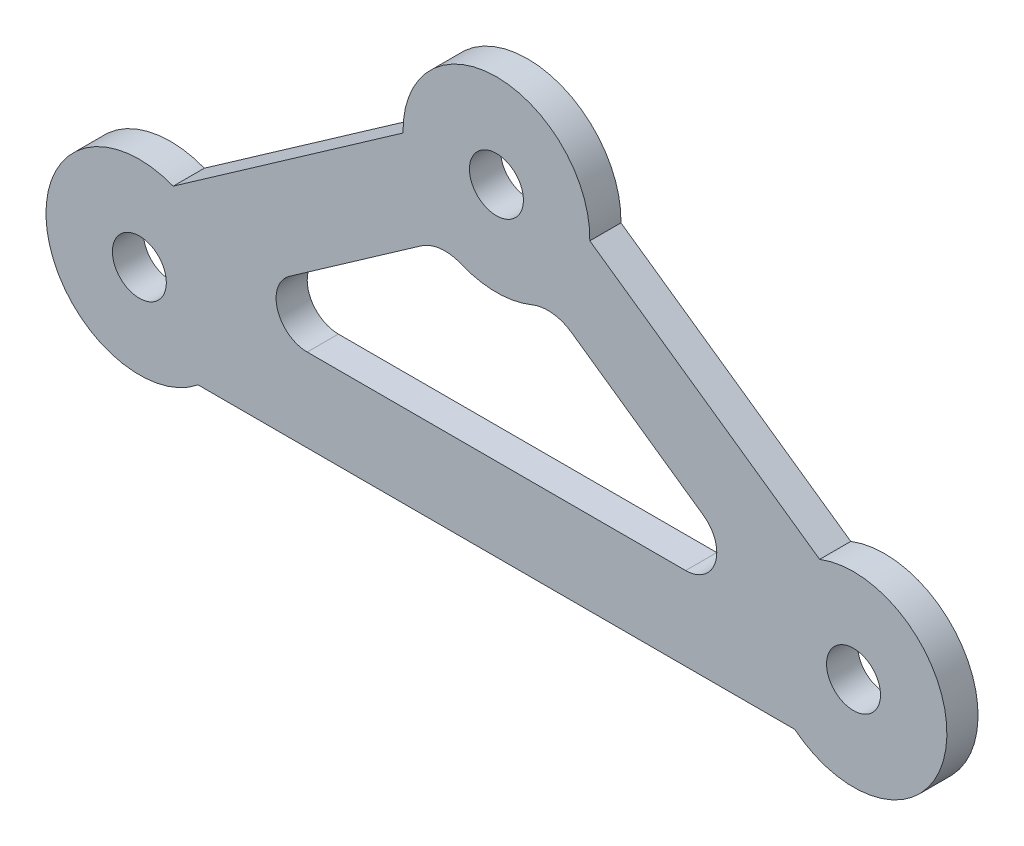
ISO-10303-21;
HEADER;
FILE_DESCRIPTION(('STEP AP214'),'2;1');
FILE_NAME('part.step','',(''),(''),'','','');
FILE_SCHEMA(('AUTOMOTIVE_DESIGN { 1 0 10303 214 1 1 1 1 }'));
ENDSEC;
DATA;
#1=APPLICATION_CONTEXT('core data for automotive mechanical design processes');
#2=APPLICATION_PROTOCOL_DEFINITION('international standard','automotive_design',2000,#1);
#3=PRODUCT_CONTEXT('',#1,'mechanical');
#4=PRODUCT('Part','Part','',(#3));
#5=PRODUCT_RELATED_PRODUCT_CATEGORY('part','',(#4));
#6=PRODUCT_DEFINITION_FORMATION('','',#4);
#7=PRODUCT_DEFINITION_CONTEXT('part definition',#1,'design');
#8=PRODUCT_DEFINITION('design','',#6,#7);
#9=PRODUCT_DEFINITION_SHAPE('','',#8);
#10=(LENGTH_UNIT() NAMED_UNIT(*) SI_UNIT(.MILLI.,.METRE.));
#11=(NAMED_UNIT(*) PLANE_ANGLE_UNIT() SI_UNIT($,.RADIAN.));
#12=(NAMED_UNIT(*) SI_UNIT($,.STERADIAN.) SOLID_ANGLE_UNIT());
#13=UNCERTAINTY_MEASURE_WITH_UNIT(LENGTH_MEASURE(1.E-05),#10,'distance_accuracy_value','');
#14=(GEOMETRIC_REPRESENTATION_CONTEXT(3) GLOBAL_UNCERTAINTY_ASSIGNED_CONTEXT((#13)) GLOBAL_UNIT_ASSIGNED_CONTEXT((#10,
#11,#12)) REPRESENTATION_CONTEXT('',''));
#15=CARTESIAN_POINT('',(0.,0.,0.));
#16=DIRECTION('',(0.,0.,1.));
#17=DIRECTION('',(1.,0.,0.));
#18=AXIS2_PLACEMENT_3D('',#15,#16,#17);
#19=CARTESIAN_POINT('',(4.95832599921369,12.0729309638631,-2.));
#20=DIRECTION('',(0.,0.,1.));
#21=DIRECTION('',(1.,0.,0.));
#22=AXIS2_PLACEMENT_3D('',#19,#20,#21);
#23=CYLINDRICAL_SURFACE('',#22,4.);
#24=DIRECTION('',(0.,0.,1.));
#25=VECTOR('',#24,1.);
#26=CARTESIAN_POINT('',(7.25263174461788,15.3495391410191,-2.));
#27=LINE('',#26,#25);
#28=CARTESIAN_POINT('',(7.25263174461788,15.3495391410191,0.));
#29=VERTEX_POINT('',#28);
#30=CARTESIAN_POINT('',(7.25263174461788,15.3495391410191,3.));
#31=VERTEX_POINT('',#30);
#32=EDGE_CURVE('E188',#29,#31,#27,.T.);
#33=ORIENTED_EDGE('',*,*,#32,.T.);
#34=CARTESIAN_POINT('',(4.95832599921369,12.0729309638631,3.));
#35=DIRECTION('',(0.,0.,-1.));
#36=DIRECTION('',(-1.,0.,0.));
#37=AXIS2_PLACEMENT_3D('',#34,#35,#36);
#38=CIRCLE('',#37,4.);
#39=CARTESIAN_POINT('',(3.43268723022486,15.7705553832111,3.));
#40=VERTEX_POINT('',#39);
#41=EDGE_CURVE('E190',#31,#40,#38,.F.);
#42=ORIENTED_EDGE('',*,*,#41,.T.);
#43=DIRECTION('',(0.,0.,1.));
#44=VECTOR('',#43,1.);
#45=CARTESIAN_POINT('',(3.43268723022486,15.7705553832111,-2.));
#46=LINE('',#45,#44);
#47=CARTESIAN_POINT('',(3.43268723022486,15.7705553832111,0.));
#48=VERTEX_POINT('',#47);
#49=EDGE_CURVE('E170',#48,#40,#46,.T.);
#50=ORIENTED_EDGE('',*,*,#49,.F.);
#51=CARTESIAN_POINT('',(4.95832599921369,12.0729309638631,0.));
#52=DIRECTION('',(0.,0.,1.));
#53=DIRECTION('',(1.,0.,0.));
#54=AXIS2_PLACEMENT_3D('',#51,#52,#53);
#55=CIRCLE('',#54,4.);
#56=EDGE_CURVE('E36',#48,#29,#55,.F.);
#57=ORIENTED_EDGE('',*,*,#56,.T.);
#58=EDGE_LOOP('',(#33,#42,#50,#57));
#59=FACE_BOUND('',#58,.T.);
#60=ADVANCED_FACE('F33',(#59),#23,.F.);
#61=CARTESIAN_POINT('',(27.7458974665322,1.,-2.));
#62=DIRECTION('',(0.573576436351047,0.819152044288991,0.));
#63=DIRECTION('',(-0.819152044288991,0.573576436351047,0.));
#64=AXIS2_PLACEMENT_3D('',#61,#62,#63);
#65=PLANE('',#64);
#66=DIRECTION('',(0.,0.,-1.));
#67=VECTOR('',#66,1.);
#68=CARTESIAN_POINT('',(19.9518423684957,6.45745613286697,-2.));
#69=LINE('',#68,#67);
#70=CARTESIAN_POINT('',(19.9518423684957,6.45745613286698,0.));
#71=VERTEX_POINT('',#70);
#72=CARTESIAN_POINT('',(19.9518423684957,6.45745613286697,3.));
#73=VERTEX_POINT('',#72);
#74=EDGE_CURVE('E185',#71,#73,#69,.F.);
#75=ORIENTED_EDGE('',*,*,#74,.T.);
#76=DIRECTION('',(-0.819152044288991,0.573576436351047,0.));
#77=VECTOR('',#76,1.);
#78=CARTESIAN_POINT('',(27.7458974665322,1.,3.));
#79=LINE('',#78,#77);
#80=EDGE_CURVE('E228',#73,#31,#79,.T.);
#81=ORIENTED_EDGE('',*,*,#80,.T.);
#82=ORIENTED_EDGE('',*,*,#32,.F.);
#83=DIRECTION('',(0.819152044288991,-0.573576436351047,0.));
#84=VECTOR('',#83,1.);
#85=CARTESIAN_POINT('',(7.25263174461788,15.3495391410191,0.));
#86=LINE('',#85,#84);
#87=EDGE_CURVE('E209',#29,#71,#86,.T.);
#88=ORIENTED_EDGE('',*,*,#87,.T.);
#89=EDGE_LOOP('',(#75,#81,#82,#88));
#90=FACE_BOUND('',#89,.T.);
#91=ADVANCED_FACE('F343',(#90),#65,.F.);
#92=CARTESIAN_POINT('',(18.2311130594426,4.,-2.));
#93=DIRECTION('',(0.,0.,-1.));
#94=DIRECTION('',(-1.,0.,0.));
#95=AXIS2_PLACEMENT_3D('',#92,#93,#94);
#96=CYLINDRICAL_SURFACE('',#95,3.);
#97=DIRECTION('',(0.,0.,-1.));
#98=VECTOR('',#97,1.);
#99=CARTESIAN_POINT('',(18.2311130594426,1.,-2.));
#100=LINE('',#99,#98);
#101=CARTESIAN_POINT('',(18.2311130594426,1.,0.));
#102=VERTEX_POINT('',#101);
#103=CARTESIAN_POINT('',(18.2311130594426,1.,3.));
#104=VERTEX_POINT('',#103);
#105=EDGE_CURVE('E182',#102,#104,#100,.F.);
#106=ORIENTED_EDGE('',*,*,#105,.T.);
#107=CARTESIAN_POINT('',(18.2311130594426,4.,3.));
#108=DIRECTION('',(0.,0.,-1.));
#109=DIRECTION('',(-1.,0.,0.));
#110=AXIS2_PLACEMENT_3D('',#107,#108,#109);
#111=CIRCLE('',#110,3.);
#112=EDGE_CURVE('E231',#104,#73,#111,.F.);
#113=ORIENTED_EDGE('',*,*,#112,.T.);
#114=ORIENTED_EDGE('',*,*,#74,.F.);
#115=CARTESIAN_POINT('',(18.2311130594426,4.,0.));
#116=DIRECTION('',(0.,0.,-1.));
#117=DIRECTION('',(-1.,0.,0.));
#118=AXIS2_PLACEMENT_3D('',#115,#116,#117);
#119=CIRCLE('',#118,3.);
#120=EDGE_CURVE('E207',#71,#102,#119,.T.);
#121=ORIENTED_EDGE('',*,*,#120,.T.);
#122=EDGE_LOOP('',(#106,#113,#114,#121));
#123=FACE_BOUND('',#122,.T.);
#124=ADVANCED_FACE('F340',(#123),#96,.F.);
#125=CARTESIAN_POINT('',(-27.7458974665322,1.,-2.));
#126=DIRECTION('',(0.,-1.,0.));
#127=DIRECTION('',(0.,0.,-1.));
#128=AXIS2_PLACEMENT_3D('',#125,#126,#127);
#129=PLANE('',#128);
#130=DIRECTION('',(0.,0.,-1.));
#131=VECTOR('',#130,1.);
#132=CARTESIAN_POINT('',(-18.2311130594426,1.,-2.));
#133=LINE('',#132,#131);
#134=CARTESIAN_POINT('',(-18.2311130594426,1.,0.));
#135=VERTEX_POINT('',#134);
#136=CARTESIAN_POINT('',(-18.2311130594426,1.,3.));
#137=VERTEX_POINT('',#136);
#138=EDGE_CURVE('E179',#135,#137,#133,.F.);
#139=ORIENTED_EDGE('',*,*,#138,.T.);
#140=DIRECTION('',(1.,0.,0.));
#141=VECTOR('',#140,1.);
#142=CARTESIAN_POINT('',(-27.7458974665322,1.,3.));
#143=LINE('',#142,#141);
#144=EDGE_CURVE('E234',#137,#104,#143,.T.);
#145=ORIENTED_EDGE('',*,*,#144,.T.);
#146=ORIENTED_EDGE('',*,*,#105,.F.);
#147=DIRECTION('',(1.,0.,0.));
#148=VECTOR('',#147,1.);
#149=CARTESIAN_POINT('',(34.4043858601376,1.,0.));
#150=LINE('',#149,#148);
#151=EDGE_CURVE('E206',#102,#135,#150,.F.);
#152=ORIENTED_EDGE('',*,*,#151,.T.);
#153=EDGE_LOOP('',(#139,#145,#146,#152));
#154=FACE_BOUND('',#153,.T.);
#155=ADVANCED_FACE('F336',(#154),#129,.F.);
#156=CARTESIAN_POINT('',(-18.2311130594426,4.,-2.));
#157=DIRECTION('',(0.,0.,-1.));
#158=DIRECTION('',(-1.,0.,0.));
#159=AXIS2_PLACEMENT_3D('',#156,#157,#158);
#160=CYLINDRICAL_SURFACE('',#159,3.);
#161=DIRECTION('',(0.,0.,1.));
#162=VECTOR('',#161,1.);
#163=CARTESIAN_POINT('',(-19.9518423684958,6.45745613286697,-2.));
#164=LINE('',#163,#162);
#165=CARTESIAN_POINT('',(-19.9518423684958,6.45745613286697,0.));
#166=VERTEX_POINT('',#165);
#167=CARTESIAN_POINT('',(-19.9518423684958,6.45745613286698,3.));
#168=VERTEX_POINT('',#167);
#169=EDGE_CURVE('E176',#166,#168,#164,.T.);
#170=ORIENTED_EDGE('',*,*,#169,.T.);
#171=CARTESIAN_POINT('',(-18.2311130594426,4.,3.));
#172=DIRECTION('',(0.,0.,-1.));
#173=DIRECTION('',(-1.,0.,0.));
#174=AXIS2_PLACEMENT_3D('',#171,#172,#173);
#175=CIRCLE('',#174,3.);
#176=EDGE_CURVE('E237',#168,#137,#175,.F.);
#177=ORIENTED_EDGE('',*,*,#176,.T.);
#178=ORIENTED_EDGE('',*,*,#138,.F.);
#179=CARTESIAN_POINT('',(-18.2311130594426,4.,0.));
#180=DIRECTION('',(0.,0.,-1.));
#181=DIRECTION('',(-1.,0.,0.));
#182=AXIS2_PLACEMENT_3D('',#179,#180,#181);
#183=CIRCLE('',#182,3.);
#184=EDGE_CURVE('E205',#135,#166,#183,.T.);
#185=ORIENTED_EDGE('',*,*,#184,.T.);
#186=EDGE_LOOP('',(#170,#177,#178,#185));
#187=FACE_BOUND('',#186,.T.);
#188=ADVANCED_FACE('F332',(#187),#160,.F.);
#189=CARTESIAN_POINT('',(-5.23000627502169,16.7657967418053,-2.));
#190=DIRECTION('',(-0.573576436351047,0.819152044288991,0.));
#191=DIRECTION('',(-0.819152044288991,-0.573576436351047,0.));
#192=AXIS2_PLACEMENT_3D('',#189,#190,#191);
#193=PLANE('',#192);
#194=DIRECTION('',(0.,0.,1.));
#195=VECTOR('',#194,1.);
#196=CARTESIAN_POINT('',(-7.2526317446179,15.3495391410191,-2.));
#197=LINE('',#196,#195);
#198=CARTESIAN_POINT('',(-7.2526317446179,15.3495391410191,0.));
#199=VERTEX_POINT('',#198);
#200=CARTESIAN_POINT('',(-7.2526317446179,15.3495391410191,3.));
#201=VERTEX_POINT('',#200);
#202=EDGE_CURVE('E173',#199,#201,#197,.T.);
#203=ORIENTED_EDGE('',*,*,#202,.T.);
#204=DIRECTION('',(-0.819152044288991,-0.573576436351047,0.));
#205=VECTOR('',#204,1.);
#206=CARTESIAN_POINT('',(-5.23000627502169,16.7657967418053,3.));
#207=LINE('',#206,#205);
#208=EDGE_CURVE('E240',#201,#168,#207,.T.);
#209=ORIENTED_EDGE('',*,*,#208,.T.);
#210=ORIENTED_EDGE('',*,*,#169,.F.);
#211=DIRECTION('',(0.819152044288991,0.573576436351047,0.));
#212=VECTOR('',#211,1.);
#213=CARTESIAN_POINT('',(-19.9518423684958,6.45745613286697,0.));
#214=LINE('',#213,#212);
#215=EDGE_CURVE('E204',#166,#199,#214,.T.);
#216=ORIENTED_EDGE('',*,*,#215,.T.);
#217=EDGE_LOOP('',(#203,#209,#210,#216));
#218=FACE_BOUND('',#217,.T.);
#219=ADVANCED_FACE('F328',(#218),#193,.F.);
#220=CARTESIAN_POINT('',(-4.95832599921371,12.0729309638632,-2.));
#221=DIRECTION('',(0.,0.,1.));
#222=DIRECTION('',(1.,0.,0.));
#223=AXIS2_PLACEMENT_3D('',#220,#221,#222);
#224=CYLINDRICAL_SURFACE('',#223,4.);
#225=DIRECTION('',(0.,0.,1.));
#226=VECTOR('',#225,1.);
#227=CARTESIAN_POINT('',(-3.43268723022488,15.7705553832111,-2.));
#228=LINE('',#227,#226);
#229=CARTESIAN_POINT('',(-3.43268723022488,15.7705553832111,3.));
#230=VERTEX_POINT('',#229);
#231=CARTESIAN_POINT('',(-3.43268723022488,15.7705553832111,0.));
#232=VERTEX_POINT('',#231);
#233=EDGE_CURVE('E168',#230,#232,#228,.F.);
#234=ORIENTED_EDGE('',*,*,#233,.F.);
#235=CARTESIAN_POINT('',(-4.95832599921371,12.0729309638632,3.));
#236=DIRECTION('',(0.,0.,-1.));
#237=DIRECTION('',(-1.,0.,0.));
#238=AXIS2_PLACEMENT_3D('',#235,#236,#237);
#239=CIRCLE('',#238,4.);
#240=EDGE_CURVE('E49',#230,#201,#239,.F.);
#241=ORIENTED_EDGE('',*,*,#240,.T.);
#242=ORIENTED_EDGE('',*,*,#202,.F.);
#243=CARTESIAN_POINT('',(-4.95832599921371,12.0729309638632,0.));
#244=DIRECTION('',(0.,0.,1.));
#245=DIRECTION('',(1.,0.,0.));
#246=AXIS2_PLACEMENT_3D('',#243,#244,#245);
#247=CIRCLE('',#246,4.);
#248=EDGE_CURVE('E201',#199,#232,#247,.F.);
#249=ORIENTED_EDGE('',*,*,#248,.T.);
#250=EDGE_LOOP('',(#234,#241,#242,#249));
#251=FACE_BOUND('',#250,.T.);
#252=ADVANCED_FACE('F324',(#251),#224,.F.);
#253=CARTESIAN_POINT('',(0.,24.090210326744,-2.));
#254=DIRECTION('',(0.,0.,1.));
#255=DIRECTION('',(1.,0.,0.));
#256=AXIS2_PLACEMENT_3D('',#253,#254,#255);
#257=CYLINDRICAL_SURFACE('',#256,9.00000000000001);
#258=CARTESIAN_POINT('',(0.,24.090210326744,3.));
#259=DIRECTION('',(0.,0.,-1.));
#260=DIRECTION('',(-1.,0.,0.));
#261=AXIS2_PLACEMENT_3D('',#258,#259,#260);
#262=CIRCLE('',#261,9.00000000000001);
#263=EDGE_CURVE('E149',#230,#40,#262,.F.);
#264=ORIENTED_EDGE('',*,*,#263,.F.);
#265=ORIENTED_EDGE('',*,*,#233,.T.);
#266=CARTESIAN_POINT('',(0.,24.090210326744,0.));
#267=DIRECTION('',(0.,0.,1.));
#268=DIRECTION('',(1.,0.,0.));
#269=AXIS2_PLACEMENT_3D('',#266,#267,#268);
#270=CIRCLE('',#269,9.00000000000001);
#271=EDGE_CURVE('E198',#232,#48,#270,.T.);
#272=ORIENTED_EDGE('',*,*,#271,.T.);
#273=ORIENTED_EDGE('',*,*,#49,.T.);
#274=EDGE_LOOP('',(#264,#265,#272,#273));
#275=FACE_BOUND('',#274,.T.);
#276=ADVANCED_FACE('F321',(#275),#257,.T.);
#277=CARTESIAN_POINT('',(8.99785477656499,23.8937175282842,5.));
#278=DIRECTION('',(-0.573576436351047,-0.819152044288991,0.));
#279=DIRECTION('',(0.819152044288991,-0.573576436351047,0.));
#280=AXIS2_PLACEMENT_3D('',#277,#278,#279);
#281=PLANE('',#280);
#282=DIRECTION('',(0.,0.,1.));
#283=VECTOR('',#282,1.);
#284=CARTESIAN_POINT('',(8.99785477656499,23.8937175282842,5.));
#285=LINE('',#284,#283);
#286=CARTESIAN_POINT('',(8.99785477656499,23.8937175282842,3.));
#287=VERTEX_POINT('',#286);
#288=CARTESIAN_POINT('',(8.99785477656499,23.8937175282842,0.));
#289=VERTEX_POINT('',#288);
#290=EDGE_CURVE('E148',#287,#289,#285,.F.);
#291=ORIENTED_EDGE('',*,*,#290,.F.);
#292=DIRECTION('',(0.819152044288991,-0.573576436351047,0.));
#293=VECTOR('',#292,1.);
#294=CARTESIAN_POINT('',(8.99785477656499,23.8937175282842,3.));
#295=LINE('',#294,#293);
#296=CARTESIAN_POINT('',(31.1422954470831,8.38801324134969,3.));
#297=VERTEX_POINT('',#296);
#298=EDGE_CURVE('E135',#287,#297,#295,.T.);
#299=ORIENTED_EDGE('',*,*,#298,.T.);
#300=DIRECTION('',(0.,0.,-1.));
#301=VECTOR('',#300,1.);
#302=CARTESIAN_POINT('',(31.1422954470831,8.38801324134969,5.));
#303=LINE('',#302,#301);
#304=CARTESIAN_POINT('',(31.1422954470831,8.38801324134969,0.));
#305=VERTEX_POINT('',#304);
#306=EDGE_CURVE('E147',#305,#297,#303,.F.);
#307=ORIENTED_EDGE('',*,*,#306,.F.);
#308=DIRECTION('',(-0.819152044288991,0.573576436351047,0.));
#309=VECTOR('',#308,1.);
#310=CARTESIAN_POINT('',(31.1422954470831,8.38801324134969,0.));
#311=LINE('',#310,#309);
#312=EDGE_CURVE('E197',#305,#289,#311,.T.);
#313=ORIENTED_EDGE('',*,*,#312,.T.);
#314=EDGE_LOOP('',(#291,#299,#307,#313));
#315=FACE_BOUND('',#314,.T.);
#316=ADVANCED_FACE('F145',(#315),#281,.F.);
#317=CARTESIAN_POINT('',(0.,24.090210326744,5.));
#318=DIRECTION('',(0.,0.,-1.));
#319=DIRECTION('',(-1.,0.,0.));
#320=AXIS2_PLACEMENT_3D('',#317,#318,#319);
#321=CYLINDRICAL_SURFACE('',#320,9.00000000000001);
#322=CARTESIAN_POINT('',(0.,24.090210326744,3.));
#323=DIRECTION('',(0.,0.,-1.));
#324=DIRECTION('',(-1.,0.,0.));
#325=AXIS2_PLACEMENT_3D('',#322,#323,#324);
#326=CIRCLE('',#325,9.00000000000001);
#327=CARTESIAN_POINT('',(-8.997854776565,23.8937175282842,3.));
#328=VERTEX_POINT('',#327);
#329=EDGE_CURVE('E150',#287,#328,#326,.F.);
#330=ORIENTED_EDGE('',*,*,#329,.F.);
#331=ORIENTED_EDGE('',*,*,#290,.T.);
#332=CARTESIAN_POINT('',(0.,24.090210326744,0.));
#333=DIRECTION('',(0.,0.,-1.));
#334=DIRECTION('',(-1.,0.,0.));
#335=AXIS2_PLACEMENT_3D('',#332,#333,#334);
#336=CIRCLE('',#335,9.00000000000001);
#337=CARTESIAN_POINT('',(-8.997854776565,23.8937175282842,0.));
#338=VERTEX_POINT('',#337);
#339=EDGE_CURVE('E195',#289,#338,#336,.F.);
#340=ORIENTED_EDGE('',*,*,#339,.T.);
#341=DIRECTION('',(0.,0.,1.));
#342=VECTOR('',#341,1.);
#343=CARTESIAN_POINT('',(-8.99785477656499,23.8937175282842,5.));
#344=LINE('',#343,#342);
#345=EDGE_CURVE('E164',#338,#328,#344,.T.);
#346=ORIENTED_EDGE('',*,*,#345,.T.);
#347=EDGE_LOOP('',(#330,#331,#340,#346));
#348=FACE_BOUND('',#347,.T.);
#349=ADVANCED_FACE('F314',(#348),#321,.T.);
#350=CARTESIAN_POINT('',(-8.99785477656499,23.8937175282842,5.));
#351=DIRECTION('',(0.573576436351047,-0.819152044288991,0.));
#352=DIRECTION('',(0.819152044288991,0.573576436351047,0.));
#353=AXIS2_PLACEMENT_3D('',#350,#351,#352);
#354=PLANE('',#353);
#355=DIRECTION('',(0.,0.,-1.));
#356=VECTOR('',#355,1.);
#357=CARTESIAN_POINT('',(-31.1422954470831,8.38801324134969,5.));
#358=LINE('',#357,#356);
#359=CARTESIAN_POINT('',(-31.1422954470831,8.38801324134969,3.));
#360=VERTEX_POINT('',#359);
#361=CARTESIAN_POINT('',(-31.1422954470831,8.38801324134969,0.));
#362=VERTEX_POINT('',#361);
#363=EDGE_CURVE('E159',#360,#362,#358,.T.);
#364=ORIENTED_EDGE('',*,*,#363,.F.);
#365=DIRECTION('',(0.819152044288991,0.573576436351047,0.));
#366=VECTOR('',#365,1.);
#367=CARTESIAN_POINT('',(-8.99785477656499,23.8937175282842,3.));
#368=LINE('',#367,#366);
#369=EDGE_CURVE('E246',#360,#328,#368,.T.);
#370=ORIENTED_EDGE('',*,*,#369,.T.);
#371=ORIENTED_EDGE('',*,*,#345,.F.);
#372=DIRECTION('',(-0.819152044288991,-0.573576436351047,0.));
#373=VECTOR('',#372,1.);
#374=CARTESIAN_POINT('',(-8.99785477656499,23.8937175282842,0.));
#375=LINE('',#374,#373);
#376=EDGE_CURVE('E194',#338,#362,#375,.T.);
#377=ORIENTED_EDGE('',*,*,#376,.T.);
#378=EDGE_LOOP('',(#364,#370,#371,#377));
#379=FACE_BOUND('',#378,.T.);
#380=ADVANCED_FACE('F310',(#379),#354,.F.);
#381=CARTESIAN_POINT('',(-34.4043858601376,0.,5.));
#382=DIRECTION('',(0.,0.,-1.));
#383=DIRECTION('',(-1.,0.,0.));
#384=AXIS2_PLACEMENT_3D('',#381,#382,#383);
#385=CYLINDRICAL_SURFACE('',#384,9.);
#386=CARTESIAN_POINT('',(-34.4043858601376,0.,3.));
#387=DIRECTION('',(0.,0.,-1.));
#388=DIRECTION('',(-1.,0.,0.));
#389=AXIS2_PLACEMENT_3D('',#386,#387,#388);
#390=CIRCLE('',#389,9.);
#391=CARTESIAN_POINT('',(-28.7475316106452,-7.,3.));
#392=VERTEX_POINT('',#391);
#393=EDGE_CURVE('E249',#360,#392,#390,.F.);
#394=ORIENTED_EDGE('',*,*,#393,.F.);
#395=ORIENTED_EDGE('',*,*,#363,.T.);
#396=CARTESIAN_POINT('',(-34.4043858601376,0.,0.));
#397=DIRECTION('',(0.,0.,-1.));
#398=DIRECTION('',(-1.,0.,0.));
#399=AXIS2_PLACEMENT_3D('',#396,#397,#398);
#400=CIRCLE('',#399,9.);
#401=CARTESIAN_POINT('',(-28.7475316106452,-7.,0.));
#402=VERTEX_POINT('',#401);
#403=EDGE_CURVE('E192',#362,#402,#400,.F.);
#404=ORIENTED_EDGE('',*,*,#403,.T.);
#405=DIRECTION('',(0.,0.,1.));
#406=VECTOR('',#405,1.);
#407=CARTESIAN_POINT('',(-28.7475316106452,-7.,5.));
#408=LINE('',#407,#406);
#409=EDGE_CURVE('E155',#402,#392,#408,.T.);
#410=ORIENTED_EDGE('',*,*,#409,.T.);
#411=EDGE_LOOP('',(#394,#395,#404,#410));
#412=FACE_BOUND('',#411,.T.);
#413=ADVANCED_FACE('F306',(#412),#385,.T.);
#414=CARTESIAN_POINT('',(-28.7475316106452,-7.,5.));
#415=DIRECTION('',(0.,1.,0.));
#416=DIRECTION('',(0.,0.,1.));
#417=AXIS2_PLACEMENT_3D('',#414,#415,#416);
#418=PLANE('',#417);
#419=DIRECTION('',(0.,0.,-1.));
#420=VECTOR('',#419,1.);
#421=CARTESIAN_POINT('',(28.7475316106453,-7.,5.));
#422=LINE('',#421,#420);
#423=CARTESIAN_POINT('',(28.7475316106453,-7.,3.));
#424=VERTEX_POINT('',#423);
#425=CARTESIAN_POINT('',(28.7475316106453,-7.,0.));
#426=VERTEX_POINT('',#425);
#427=EDGE_CURVE('E154',#424,#426,#422,.T.);
#428=ORIENTED_EDGE('',*,*,#427,.F.);
#429=DIRECTION('',(-1.,0.,0.));
#430=VECTOR('',#429,1.);
#431=CARTESIAN_POINT('',(-28.7475316106452,-7.,3.));
#432=LINE('',#431,#430);
#433=EDGE_CURVE('E57',#424,#392,#432,.T.);
#434=ORIENTED_EDGE('',*,*,#433,.T.);
#435=ORIENTED_EDGE('',*,*,#409,.F.);
#436=DIRECTION('',(1.,0.,0.));
#437=VECTOR('',#436,1.);
#438=CARTESIAN_POINT('',(34.4043858601376,-7.,0.));
#439=LINE('',#438,#437);
#440=EDGE_CURVE('E41',#402,#426,#439,.T.);
#441=ORIENTED_EDGE('',*,*,#440,.T.);
#442=EDGE_LOOP('',(#428,#434,#435,#441));
#443=FACE_BOUND('',#442,.T.);
#444=ADVANCED_FACE('F301',(#443),#418,.F.);
#445=CARTESIAN_POINT('',(34.4043858601376,0.,5.));
#446=DIRECTION('',(0.,0.,-1.));
#447=DIRECTION('',(-1.,0.,0.));
#448=AXIS2_PLACEMENT_3D('',#445,#446,#447);
#449=CYLINDRICAL_SURFACE('',#448,8.99999999999999);
#450=CARTESIAN_POINT('',(34.4043858601376,0.,3.));
#451=DIRECTION('',(0.,0.,-1.));
#452=DIRECTION('',(-1.,0.,0.));
#453=AXIS2_PLACEMENT_3D('',#450,#451,#452);
#454=CIRCLE('',#453,8.99999999999999);
#455=EDGE_CURVE('E132',#424,#297,#454,.F.);
#456=ORIENTED_EDGE('',*,*,#455,.F.);
#457=ORIENTED_EDGE('',*,*,#427,.T.);
#458=CARTESIAN_POINT('',(34.4043858601376,0.,0.));
#459=DIRECTION('',(0.,0.,-1.));
#460=DIRECTION('',(-1.,0.,0.));
#461=AXIS2_PLACEMENT_3D('',#458,#459,#460);
#462=CIRCLE('',#461,8.99999999999999);
#463=EDGE_CURVE('E11',#426,#305,#462,.F.);
#464=ORIENTED_EDGE('',*,*,#463,.T.);
#465=ORIENTED_EDGE('',*,*,#306,.T.);
#466=EDGE_LOOP('',(#456,#457,#464,#465));
#467=FACE_BOUND('',#466,.T.);
#468=ADVANCED_FACE('F152',(#467),#449,.T.);
#469=CARTESIAN_POINT('',(34.4043858601376,0.,0.));
#470=DIRECTION('',(0.,0.,1.));
#471=DIRECTION('',(1.,0.,0.));
#472=AXIS2_PLACEMENT_3D('',#469,#470,#471);
#473=PLANE('',#472);
#474=CARTESIAN_POINT('',(34.4043858601376,0.,0.));
#475=DIRECTION('',(0.,0.,1.));
#476=DIRECTION('',(1.,0.,0.));
#477=AXIS2_PLACEMENT_3D('',#474,#475,#476);
#478=CIRCLE('',#477,2.6);
#479=CARTESIAN_POINT('',(37.0043858601376,0.,0.));
#480=VERTEX_POINT('',#479);
#481=EDGE_CURVE('E261',#480,#480,#478,.T.);
#482=ORIENTED_EDGE('',*,*,#481,.T.);
#483=EDGE_LOOP('',(#482));
#484=FACE_BOUND('',#483,.T.);
#485=CARTESIAN_POINT('',(-34.4043858601376,0.,0.));
#486=DIRECTION('',(0.,0.,1.));
#487=DIRECTION('',(1.,0.,0.));
#488=AXIS2_PLACEMENT_3D('',#485,#486,#487);
#489=CIRCLE('',#488,2.6);
#490=CARTESIAN_POINT('',(-31.8043858601376,0.,0.));
#491=VERTEX_POINT('',#490);
#492=EDGE_CURVE('E255',#491,#491,#489,.T.);
#493=ORIENTED_EDGE('',*,*,#492,.T.);
#494=EDGE_LOOP('',(#493));
#495=FACE_BOUND('',#494,.T.);
#496=ORIENTED_EDGE('',*,*,#440,.F.);
#497=ORIENTED_EDGE('',*,*,#403,.F.);
#498=ORIENTED_EDGE('',*,*,#376,.F.);
#499=ORIENTED_EDGE('',*,*,#339,.F.);
#500=ORIENTED_EDGE('',*,*,#312,.F.);
#501=ORIENTED_EDGE('',*,*,#463,.F.);
#502=EDGE_LOOP('',(#496,#497,#498,#499,#500,#501));
#503=FACE_BOUND('',#502,.T.);
#504=ORIENTED_EDGE('',*,*,#248,.F.);
#505=ORIENTED_EDGE('',*,*,#215,.F.);
#506=ORIENTED_EDGE('',*,*,#184,.F.);
#507=ORIENTED_EDGE('',*,*,#151,.F.);
#508=ORIENTED_EDGE('',*,*,#120,.F.);
#509=ORIENTED_EDGE('',*,*,#87,.F.);
#510=ORIENTED_EDGE('',*,*,#56,.F.);
#511=ORIENTED_EDGE('',*,*,#271,.F.);
#512=EDGE_LOOP('',(#504,#505,#506,#507,#508,#509,#510,#511));
#513=FACE_BOUND('',#512,.T.);
#514=CARTESIAN_POINT('',(0.,24.090210326744,0.));
#515=DIRECTION('',(0.,0.,1.));
#516=DIRECTION('',(1.,0.,0.));
#517=AXIS2_PLACEMENT_3D('',#514,#515,#516);
#518=CIRCLE('',#517,2.6);
#519=CARTESIAN_POINT('',(2.6,24.090210326744,0.));
#520=VERTEX_POINT('',#519);
#521=EDGE_CURVE('E140',#520,#520,#518,.T.);
#522=ORIENTED_EDGE('',*,*,#521,.T.);
#523=EDGE_LOOP('',(#522));
#524=FACE_BOUND('',#523,.T.);
#525=ADVANCED_FACE('F270',(#484,#495,#503,#513,#524),#473,.F.);
#526=CARTESIAN_POINT('',(0.,0.,3.));
#527=DIRECTION('',(0.,0.,-1.));
#528=DIRECTION('',(-1.,0.,0.));
#529=AXIS2_PLACEMENT_3D('',#526,#527,#528);
#530=PLANE('',#529);
#531=CARTESIAN_POINT('',(34.4043858601376,0.,3.));
#532=DIRECTION('',(0.,0.,1.));
#533=DIRECTION('',(1.,0.,0.));
#534=AXIS2_PLACEMENT_3D('',#531,#532,#533);
#535=CIRCLE('',#534,2.6);
#536=CARTESIAN_POINT('',(37.0043858601376,0.,3.));
#537=VERTEX_POINT('',#536);
#538=EDGE_CURVE('E264',#537,#537,#535,.T.);
#539=ORIENTED_EDGE('',*,*,#538,.F.);
#540=EDGE_LOOP('',(#539));
#541=FACE_BOUND('',#540,.T.);
#542=CARTESIAN_POINT('',(-34.4043858601376,0.,3.));
#543=DIRECTION('',(0.,0.,1.));
#544=DIRECTION('',(1.,0.,0.));
#545=AXIS2_PLACEMENT_3D('',#542,#543,#544);
#546=CIRCLE('',#545,2.6);
#547=CARTESIAN_POINT('',(-31.8043858601376,0.,3.));
#548=VERTEX_POINT('',#547);
#549=EDGE_CURVE('E258',#548,#548,#546,.T.);
#550=ORIENTED_EDGE('',*,*,#549,.F.);
#551=EDGE_LOOP('',(#550));
#552=FACE_BOUND('',#551,.T.);
#553=ORIENTED_EDGE('',*,*,#329,.T.);
#554=ORIENTED_EDGE('',*,*,#369,.F.);
#555=ORIENTED_EDGE('',*,*,#393,.T.);
#556=ORIENTED_EDGE('',*,*,#433,.F.);
#557=ORIENTED_EDGE('',*,*,#455,.T.);
#558=ORIENTED_EDGE('',*,*,#298,.F.);
#559=EDGE_LOOP('',(#553,#554,#555,#556,#557,#558));
#560=FACE_BOUND('',#559,.T.);
#561=ORIENTED_EDGE('',*,*,#80,.F.);
#562=ORIENTED_EDGE('',*,*,#112,.F.);
#563=ORIENTED_EDGE('',*,*,#144,.F.);
#564=ORIENTED_EDGE('',*,*,#176,.F.);
#565=ORIENTED_EDGE('',*,*,#208,.F.);
#566=ORIENTED_EDGE('',*,*,#240,.F.);
#567=ORIENTED_EDGE('',*,*,#263,.T.);
#568=ORIENTED_EDGE('',*,*,#41,.F.);
#569=EDGE_LOOP('',(#561,#562,#563,#564,#565,#566,#567,#568));
#570=FACE_BOUND('',#569,.T.);
#571=CARTESIAN_POINT('',(0.,24.090210326744,3.));
#572=DIRECTION('',(0.,0.,1.));
#573=DIRECTION('',(1.,0.,0.));
#574=AXIS2_PLACEMENT_3D('',#571,#572,#573);
#575=CIRCLE('',#574,2.6);
#576=CARTESIAN_POINT('',(2.6,24.090210326744,3.));
#577=VERTEX_POINT('',#576);
#578=EDGE_CURVE('E252',#577,#577,#575,.T.);
#579=ORIENTED_EDGE('',*,*,#578,.F.);
#580=EDGE_LOOP('',(#579));
#581=FACE_BOUND('',#580,.T.);
#582=ADVANCED_FACE('F134',(#541,#552,#560,#570,#581),#530,.F.);
#583=CARTESIAN_POINT('',(0.,24.090210326744,0.));
#584=DIRECTION('',(0.,0.,1.));
#585=DIRECTION('',(1.,0.,0.));
#586=AXIS2_PLACEMENT_3D('',#583,#584,#585);
#587=CYLINDRICAL_SURFACE('',#586,2.6);
#588=ORIENTED_EDGE('',*,*,#521,.F.);
#589=EDGE_LOOP('',(#588));
#590=FACE_BOUND('',#589,.T.);
#591=ORIENTED_EDGE('',*,*,#578,.T.);
#592=EDGE_LOOP('',(#591));
#593=FACE_BOUND('',#592,.T.);
#594=ADVANCED_FACE('F282',(#590,#593),#587,.F.);
#595=CARTESIAN_POINT('',(-34.4043858601376,0.,0.));
#596=DIRECTION('',(0.,0.,1.));
#597=DIRECTION('',(1.,0.,0.));
#598=AXIS2_PLACEMENT_3D('',#595,#596,#597);
#599=CYLINDRICAL_SURFACE('',#598,2.6);
#600=ORIENTED_EDGE('',*,*,#492,.F.);
#601=EDGE_LOOP('',(#600));
#602=FACE_BOUND('',#601,.T.);
#603=ORIENTED_EDGE('',*,*,#549,.T.);
#604=EDGE_LOOP('',(#603));
#605=FACE_BOUND('',#604,.T.);
#606=ADVANCED_FACE('F276',(#602,#605),#599,.F.);
#607=CARTESIAN_POINT('',(34.4043858601376,0.,0.));
#608=DIRECTION('',(0.,0.,1.));
#609=DIRECTION('',(1.,0.,0.));
#610=AXIS2_PLACEMENT_3D('',#607,#608,#609);
#611=CYLINDRICAL_SURFACE('',#610,2.6);
#612=ORIENTED_EDGE('',*,*,#481,.F.);
#613=EDGE_LOOP('',(#612));
#614=FACE_BOUND('',#613,.T.);
#615=ORIENTED_EDGE('',*,*,#538,.T.);
#616=EDGE_LOOP('',(#615));
#617=FACE_BOUND('',#616,.T.);
#618=ADVANCED_FACE('F273',(#614,#617),#611,.F.);
#619=CLOSED_SHELL('',(#60,#91,#124,#155,#188,#219,#252,#276,#316,#349,#380,#413,#444,#468,#525,
#582,#594,#606,#618));
#620=MANIFOLD_SOLID_BREP('B2',#619);
#621=ADVANCED_BREP_SHAPE_REPRESENTATION('',(#18,#620),#14);
#622=SHAPE_DEFINITION_REPRESENTATION(#9,#621);
ENDSEC;
END-ISO-10303-21;
